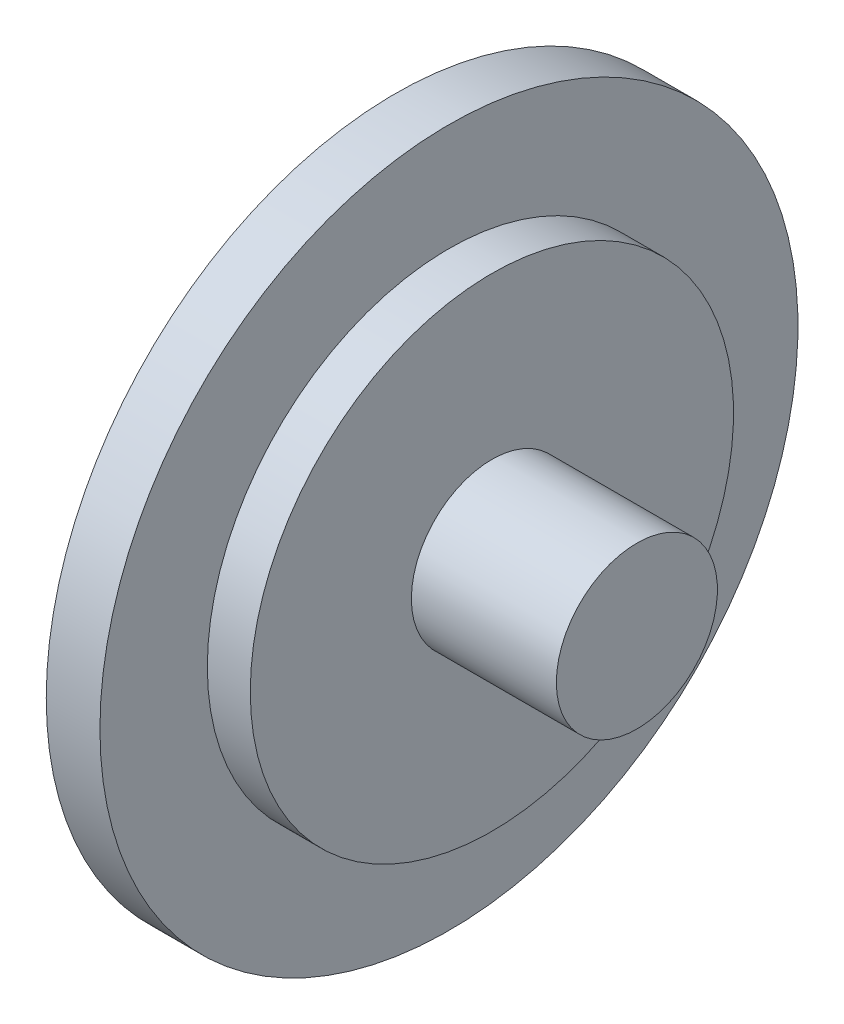
ISO-10303-21;
HEADER;
FILE_DESCRIPTION(('STEP AP214'),'2;1');
FILE_NAME('part.step','',(''),(''),'','','');
FILE_SCHEMA(('AUTOMOTIVE_DESIGN { 1 0 10303 214 1 1 1 1 }'));
ENDSEC;
DATA;
#1=APPLICATION_CONTEXT('core data for automotive mechanical design processes');
#2=APPLICATION_PROTOCOL_DEFINITION('international standard','automotive_design',2000,#1);
#3=PRODUCT_CONTEXT('',#1,'mechanical');
#4=PRODUCT('Part','Part','',(#3));
#5=PRODUCT_RELATED_PRODUCT_CATEGORY('part','',(#4));
#6=PRODUCT_DEFINITION_FORMATION('','',#4);
#7=PRODUCT_DEFINITION_CONTEXT('part definition',#1,'design');
#8=PRODUCT_DEFINITION('design','',#6,#7);
#9=PRODUCT_DEFINITION_SHAPE('','',#8);
#10=(LENGTH_UNIT() NAMED_UNIT(*) SI_UNIT(.MILLI.,.METRE.));
#11=(NAMED_UNIT(*) PLANE_ANGLE_UNIT() SI_UNIT($,.RADIAN.));
#12=(NAMED_UNIT(*) SI_UNIT($,.STERADIAN.) SOLID_ANGLE_UNIT());
#13=UNCERTAINTY_MEASURE_WITH_UNIT(LENGTH_MEASURE(1.E-05),#10,'distance_accuracy_value','');
#14=(GEOMETRIC_REPRESENTATION_CONTEXT(3) GLOBAL_UNCERTAINTY_ASSIGNED_CONTEXT((#13)) GLOBAL_UNIT_ASSIGNED_CONTEXT((#10,
#11,#12)) REPRESENTATION_CONTEXT('',''));
#15=CARTESIAN_POINT('',(0.,0.,0.));
#16=DIRECTION('',(0.,0.,1.));
#17=DIRECTION('',(1.,0.,0.));
#18=AXIS2_PLACEMENT_3D('',#15,#16,#17);
#19=CARTESIAN_POINT('',(0.,0.,0.));
#20=DIRECTION('',(1.,0.,0.));
#21=DIRECTION('',(0.,0.,-1.));
#22=AXIS2_PLACEMENT_3D('',#19,#20,#21);
#23=PLANE('',#22);
#24=CARTESIAN_POINT('',(0.,0.,0.));
#25=DIRECTION('',(-1.,0.,0.));
#26=DIRECTION('',(0.,0.,1.));
#27=AXIS2_PLACEMENT_3D('',#24,#25,#26);
#28=CIRCLE('',#27,13.);
#29=CARTESIAN_POINT('',(0.,0.,13.));
#30=VERTEX_POINT('',#29);
#31=EDGE_CURVE('E10',#30,#30,#28,.T.);
#32=ORIENTED_EDGE('',*,*,#31,.T.);
#33=EDGE_LOOP('',(#32));
#34=FACE_BOUND('',#33,.T.);
#35=ADVANCED_FACE('F32',(#34),#23,.F.);
#36=CARTESIAN_POINT('',(0.,0.,0.));
#37=DIRECTION('',(-1.,0.,0.));
#38=DIRECTION('',(0.,0.,1.));
#39=AXIS2_PLACEMENT_3D('',#36,#37,#38);
#40=CYLINDRICAL_SURFACE('',#39,13.);
#41=ORIENTED_EDGE('',*,*,#31,.F.);
#42=EDGE_LOOP('',(#41));
#43=FACE_BOUND('',#42,.T.);
#44=CARTESIAN_POINT('',(2.,0.,0.));
#45=DIRECTION('',(-1.,0.,0.));
#46=DIRECTION('',(0.,0.,1.));
#47=AXIS2_PLACEMENT_3D('',#44,#45,#46);
#48=CIRCLE('',#47,13.);
#49=CARTESIAN_POINT('',(2.,0.,13.));
#50=VERTEX_POINT('',#49);
#51=EDGE_CURVE('E38',#50,#50,#48,.T.);
#52=ORIENTED_EDGE('',*,*,#51,.T.);
#53=EDGE_LOOP('',(#52));
#54=FACE_BOUND('',#53,.T.);
#55=ADVANCED_FACE('F70',(#43,#54),#40,.T.);
#56=CARTESIAN_POINT('',(2.,13.,0.));
#57=DIRECTION('',(-1.,0.,0.));
#58=DIRECTION('',(0.,0.,1.));
#59=AXIS2_PLACEMENT_3D('',#56,#57,#58);
#60=PLANE('',#59);
#61=ORIENTED_EDGE('',*,*,#51,.F.);
#62=EDGE_LOOP('',(#61));
#63=FACE_BOUND('',#62,.T.);
#64=CARTESIAN_POINT('',(2.,0.,0.));
#65=DIRECTION('',(-1.,0.,0.));
#66=DIRECTION('',(0.,0.,1.));
#67=AXIS2_PLACEMENT_3D('',#64,#65,#66);
#68=CIRCLE('',#67,9.);
#69=CARTESIAN_POINT('',(2.,0.,9.));
#70=VERTEX_POINT('',#69);
#71=EDGE_CURVE('E42',#70,#70,#68,.T.);
#72=ORIENTED_EDGE('',*,*,#71,.T.);
#73=EDGE_LOOP('',(#72));
#74=FACE_BOUND('',#73,.T.);
#75=ADVANCED_FACE('F74',(#63,#74),#60,.F.);
#76=CARTESIAN_POINT('',(0.,0.,0.));
#77=DIRECTION('',(-1.,0.,0.));
#78=DIRECTION('',(0.,0.,1.));
#79=AXIS2_PLACEMENT_3D('',#76,#77,#78);
#80=CYLINDRICAL_SURFACE('',#79,9.);
#81=ORIENTED_EDGE('',*,*,#71,.F.);
#82=EDGE_LOOP('',(#81));
#83=FACE_BOUND('',#82,.T.);
#84=CARTESIAN_POINT('',(3.6,0.,0.));
#85=DIRECTION('',(-1.,0.,0.));
#86=DIRECTION('',(0.,0.,1.));
#87=AXIS2_PLACEMENT_3D('',#84,#85,#86);
#88=CIRCLE('',#87,9.);
#89=CARTESIAN_POINT('',(3.6,0.,9.));
#90=VERTEX_POINT('',#89);
#91=EDGE_CURVE('E46',#90,#90,#88,.T.);
#92=ORIENTED_EDGE('',*,*,#91,.T.);
#93=EDGE_LOOP('',(#92));
#94=FACE_BOUND('',#93,.T.);
#95=ADVANCED_FACE('F79',(#83,#94),#80,.T.);
#96=CARTESIAN_POINT('',(3.6,9.,0.));
#97=DIRECTION('',(-1.,0.,0.));
#98=DIRECTION('',(0.,0.,1.));
#99=AXIS2_PLACEMENT_3D('',#96,#97,#98);
#100=PLANE('',#99);
#101=ORIENTED_EDGE('',*,*,#91,.F.);
#102=EDGE_LOOP('',(#101));
#103=FACE_BOUND('',#102,.T.);
#104=CARTESIAN_POINT('',(3.6,0.,0.));
#105=DIRECTION('',(-1.,0.,0.));
#106=DIRECTION('',(0.,0.,1.));
#107=AXIS2_PLACEMENT_3D('',#104,#105,#106);
#108=CIRCLE('',#107,3.);
#109=CARTESIAN_POINT('',(3.6,0.,3.));
#110=VERTEX_POINT('',#109);
#111=EDGE_CURVE('E51',#110,#110,#108,.T.);
#112=ORIENTED_EDGE('',*,*,#111,.T.);
#113=EDGE_LOOP('',(#112));
#114=FACE_BOUND('',#113,.T.);
#115=ADVANCED_FACE('F66',(#103,#114),#100,.F.);
#116=CARTESIAN_POINT('',(0.,0.,0.));
#117=DIRECTION('',(-1.,0.,0.));
#118=DIRECTION('',(0.,0.,1.));
#119=AXIS2_PLACEMENT_3D('',#116,#117,#118);
#120=CYLINDRICAL_SURFACE('',#119,3.);
#121=ORIENTED_EDGE('',*,*,#111,.F.);
#122=EDGE_LOOP('',(#121));
#123=FACE_BOUND('',#122,.T.);
#124=CARTESIAN_POINT('',(9.,0.,0.));
#125=DIRECTION('',(-1.,0.,0.));
#126=DIRECTION('',(0.,0.,1.));
#127=AXIS2_PLACEMENT_3D('',#124,#125,#126);
#128=CIRCLE('',#127,3.);
#129=CARTESIAN_POINT('',(9.,0.,3.));
#130=VERTEX_POINT('',#129);
#131=EDGE_CURVE('E54',#130,#130,#128,.T.);
#132=ORIENTED_EDGE('',*,*,#131,.T.);
#133=EDGE_LOOP('',(#132));
#134=FACE_BOUND('',#133,.T.);
#135=ADVANCED_FACE('F58',(#123,#134),#120,.T.);
#136=CARTESIAN_POINT('',(9.,3.,0.));
#137=DIRECTION('',(-1.,0.,0.));
#138=DIRECTION('',(0.,0.,1.));
#139=AXIS2_PLACEMENT_3D('',#136,#137,#138);
#140=PLANE('',#139);
#141=ORIENTED_EDGE('',*,*,#131,.F.);
#142=EDGE_LOOP('',(#141));
#143=FACE_BOUND('',#142,.T.);
#144=ADVANCED_FACE('F60',(#143),#140,.F.);
#145=CLOSED_SHELL('',(#35,#55,#75,#95,#115,#135,#144));
#146=MANIFOLD_SOLID_BREP('B2',#145);
#147=ADVANCED_BREP_SHAPE_REPRESENTATION('',(#18,#146),#14);
#148=SHAPE_DEFINITION_REPRESENTATION(#9,#147);
ENDSEC;
END-ISO-10303-21;
